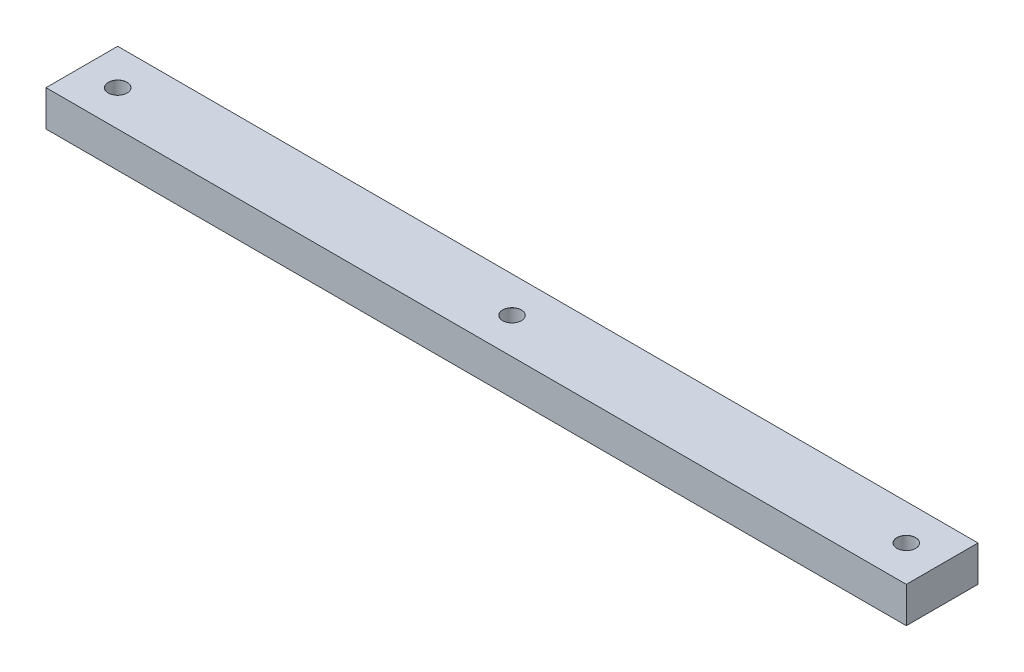
ISO-10303-21;
HEADER;
FILE_DESCRIPTION(('STEP AP214'),'2;1');
FILE_NAME('part.step','',(''),(''),'','','');
FILE_SCHEMA(('AUTOMOTIVE_DESIGN { 1 0 10303 214 1 1 1 1 }'));
ENDSEC;
DATA;
#1=APPLICATION_CONTEXT('core data for automotive mechanical design processes');
#2=APPLICATION_PROTOCOL_DEFINITION('international standard','automotive_design',2000,#1);
#3=PRODUCT_CONTEXT('',#1,'mechanical');
#4=PRODUCT('Part','Part','',(#3));
#5=PRODUCT_RELATED_PRODUCT_CATEGORY('part','',(#4));
#6=PRODUCT_DEFINITION_FORMATION('','',#4);
#7=PRODUCT_DEFINITION_CONTEXT('part definition',#1,'design');
#8=PRODUCT_DEFINITION('design','',#6,#7);
#9=PRODUCT_DEFINITION_SHAPE('','',#8);
#10=(LENGTH_UNIT() NAMED_UNIT(*) SI_UNIT(.MILLI.,.METRE.));
#11=(NAMED_UNIT(*) PLANE_ANGLE_UNIT() SI_UNIT($,.RADIAN.));
#12=(NAMED_UNIT(*) SI_UNIT($,.STERADIAN.) SOLID_ANGLE_UNIT());
#13=UNCERTAINTY_MEASURE_WITH_UNIT(LENGTH_MEASURE(1.E-05),#10,'distance_accuracy_value','');
#14=(GEOMETRIC_REPRESENTATION_CONTEXT(3) GLOBAL_UNCERTAINTY_ASSIGNED_CONTEXT((#13)) GLOBAL_UNIT_ASSIGNED_CONTEXT((#10,
#11,#12)) REPRESENTATION_CONTEXT('',''));
#15=CARTESIAN_POINT('',(0.,0.,0.));
#16=DIRECTION('',(0.,0.,1.));
#17=DIRECTION('',(1.,0.,0.));
#18=AXIS2_PLACEMENT_3D('',#15,#16,#17);
#19=CARTESIAN_POINT('',(-152.4,12.7,12.7));
#20=DIRECTION('',(1.,0.,0.));
#21=DIRECTION('',(0.,0.,-1.));
#22=AXIS2_PLACEMENT_3D('',#19,#20,#21);
#23=PLANE('',#22);
#24=DIRECTION('',(0.,0.,1.));
#25=VECTOR('',#24,1.);
#26=CARTESIAN_POINT('',(-152.4,0.,12.7));
#27=LINE('',#26,#25);
#28=CARTESIAN_POINT('',(-152.4,0.,-12.7));
#29=VERTEX_POINT('',#28);
#30=CARTESIAN_POINT('',(-152.4,0.,12.7));
#31=VERTEX_POINT('',#30);
#32=EDGE_CURVE('E102',#29,#31,#27,.T.);
#33=ORIENTED_EDGE('',*,*,#32,.T.);
#34=DIRECTION('',(0.,-1.,0.));
#35=VECTOR('',#34,1.);
#36=CARTESIAN_POINT('',(-152.4,12.7,12.7));
#37=LINE('',#36,#35);
#38=CARTESIAN_POINT('',(-152.4,12.7,12.7));
#39=VERTEX_POINT('',#38);
#40=EDGE_CURVE('E11',#39,#31,#37,.T.);
#41=ORIENTED_EDGE('',*,*,#40,.F.);
#42=DIRECTION('',(0.,0.,1.));
#43=VECTOR('',#42,1.);
#44=CARTESIAN_POINT('',(-152.4,12.7,12.7));
#45=LINE('',#44,#43);
#46=CARTESIAN_POINT('',(-152.4,12.7,-12.7));
#47=VERTEX_POINT('',#46);
#48=EDGE_CURVE('E90',#47,#39,#45,.T.);
#49=ORIENTED_EDGE('',*,*,#48,.F.);
#50=DIRECTION('',(0.,-1.,0.));
#51=VECTOR('',#50,1.);
#52=CARTESIAN_POINT('',(-152.4,12.7,-12.7));
#53=LINE('',#52,#51);
#54=EDGE_CURVE('E98',#47,#29,#53,.T.);
#55=ORIENTED_EDGE('',*,*,#54,.T.);
#56=EDGE_LOOP('',(#33,#41,#49,#55));
#57=FACE_BOUND('',#56,.T.);
#58=ADVANCED_FACE('F39',(#57),#23,.F.);
#59=CARTESIAN_POINT('',(152.4,12.7,12.7));
#60=DIRECTION('',(0.,0.,-1.));
#61=DIRECTION('',(-1.,0.,0.));
#62=AXIS2_PLACEMENT_3D('',#59,#60,#61);
#63=PLANE('',#62);
#64=DIRECTION('',(1.,0.,0.));
#65=VECTOR('',#64,1.);
#66=CARTESIAN_POINT('',(152.4,0.,12.7));
#67=LINE('',#66,#65);
#68=CARTESIAN_POINT('',(152.4,0.,12.7));
#69=VERTEX_POINT('',#68);
#70=EDGE_CURVE('E94',#31,#69,#67,.T.);
#71=ORIENTED_EDGE('',*,*,#70,.T.);
#72=DIRECTION('',(0.,-1.,0.));
#73=VECTOR('',#72,1.);
#74=CARTESIAN_POINT('',(152.4,12.7,12.7));
#75=LINE('',#74,#73);
#76=CARTESIAN_POINT('',(152.4,12.7,12.7));
#77=VERTEX_POINT('',#76);
#78=EDGE_CURVE('E47',#77,#69,#75,.T.);
#79=ORIENTED_EDGE('',*,*,#78,.F.);
#80=DIRECTION('',(1.,0.,0.));
#81=VECTOR('',#80,1.);
#82=CARTESIAN_POINT('',(152.4,12.7,12.7));
#83=LINE('',#82,#81);
#84=EDGE_CURVE('E85',#39,#77,#83,.T.);
#85=ORIENTED_EDGE('',*,*,#84,.F.);
#86=ORIENTED_EDGE('',*,*,#40,.T.);
#87=EDGE_LOOP('',(#71,#79,#85,#86));
#88=FACE_BOUND('',#87,.T.);
#89=ADVANCED_FACE('F93',(#88),#63,.F.);
#90=CARTESIAN_POINT('',(152.4,12.7,12.7));
#91=DIRECTION('',(-1.,0.,0.));
#92=DIRECTION('',(0.,0.,1.));
#93=AXIS2_PLACEMENT_3D('',#90,#91,#92);
#94=PLANE('',#93);
#95=DIRECTION('',(0.,0.,-1.));
#96=VECTOR('',#95,1.);
#97=CARTESIAN_POINT('',(152.4,0.,12.7));
#98=LINE('',#97,#96);
#99=CARTESIAN_POINT('',(152.4,0.,-12.7));
#100=VERTEX_POINT('',#99);
#101=EDGE_CURVE('E72',#69,#100,#98,.T.);
#102=ORIENTED_EDGE('',*,*,#101,.T.);
#103=DIRECTION('',(0.,-1.,0.));
#104=VECTOR('',#103,1.);
#105=CARTESIAN_POINT('',(152.4,12.7,-12.7));
#106=LINE('',#105,#104);
#107=CARTESIAN_POINT('',(152.4,12.7,-12.7));
#108=VERTEX_POINT('',#107);
#109=EDGE_CURVE('E95',#108,#100,#106,.T.);
#110=ORIENTED_EDGE('',*,*,#109,.F.);
#111=DIRECTION('',(0.,0.,-1.));
#112=VECTOR('',#111,1.);
#113=CARTESIAN_POINT('',(152.4,12.7,12.7));
#114=LINE('',#113,#112);
#115=EDGE_CURVE('E88',#77,#108,#114,.T.);
#116=ORIENTED_EDGE('',*,*,#115,.F.);
#117=ORIENTED_EDGE('',*,*,#78,.T.);
#118=EDGE_LOOP('',(#102,#110,#116,#117));
#119=FACE_BOUND('',#118,.T.);
#120=ADVANCED_FACE('F96',(#119),#94,.F.);
#121=CARTESIAN_POINT('',(152.4,12.7,-12.7));
#122=DIRECTION('',(0.,0.,1.));
#123=DIRECTION('',(1.,0.,0.));
#124=AXIS2_PLACEMENT_3D('',#121,#122,#123);
#125=PLANE('',#124);
#126=DIRECTION('',(-1.,0.,0.));
#127=VECTOR('',#126,1.);
#128=CARTESIAN_POINT('',(152.4,0.,-12.7));
#129=LINE('',#128,#127);
#130=EDGE_CURVE('E78',#100,#29,#129,.T.);
#131=ORIENTED_EDGE('',*,*,#130,.T.);
#132=ORIENTED_EDGE('',*,*,#54,.F.);
#133=DIRECTION('',(-1.,0.,0.));
#134=VECTOR('',#133,1.);
#135=CARTESIAN_POINT('',(152.4,12.7,-12.7));
#136=LINE('',#135,#134);
#137=EDGE_CURVE('E55',#108,#47,#136,.T.);
#138=ORIENTED_EDGE('',*,*,#137,.F.);
#139=ORIENTED_EDGE('',*,*,#109,.T.);
#140=EDGE_LOOP('',(#131,#132,#138,#139));
#141=FACE_BOUND('',#140,.T.);
#142=ADVANCED_FACE('F110',(#141),#125,.F.);
#143=CARTESIAN_POINT('',(0.,12.7,0.));
#144=DIRECTION('',(0.,1.,0.));
#145=DIRECTION('',(0.,0.,1.));
#146=AXIS2_PLACEMENT_3D('',#143,#144,#145);
#147=PLANE('',#146);
#148=CARTESIAN_POINT('',(0.,12.7,0.));
#149=DIRECTION('',(0.,1.,0.));
#150=DIRECTION('',(0.,0.,1.));
#151=AXIS2_PLACEMENT_3D('',#148,#149,#150);
#152=CIRCLE('',#151,3.325);
#153=CARTESIAN_POINT('',(0.,12.7,3.325));
#154=VERTEX_POINT('',#153);
#155=EDGE_CURVE('E139',#154,#154,#152,.T.);
#156=ORIENTED_EDGE('',*,*,#155,.F.);
#157=EDGE_LOOP('',(#156));
#158=FACE_BOUND('',#157,.T.);
#159=CARTESIAN_POINT('',(-139.7,12.7,0.));
#160=DIRECTION('',(0.,1.,0.));
#161=DIRECTION('',(0.,0.,1.));
#162=AXIS2_PLACEMENT_3D('',#159,#160,#161);
#163=CIRCLE('',#162,3.32499999999999);
#164=CARTESIAN_POINT('',(-139.7,12.7,3.32500000000001));
#165=VERTEX_POINT('',#164);
#166=EDGE_CURVE('E130',#165,#165,#163,.T.);
#167=ORIENTED_EDGE('',*,*,#166,.F.);
#168=EDGE_LOOP('',(#167));
#169=FACE_BOUND('',#168,.T.);
#170=CARTESIAN_POINT('',(139.7,12.7,0.));
#171=DIRECTION('',(0.,1.,0.));
#172=DIRECTION('',(0.,0.,1.));
#173=AXIS2_PLACEMENT_3D('',#170,#171,#172);
#174=CIRCLE('',#173,3.32499999999999);
#175=CARTESIAN_POINT('',(139.7,12.7,3.32500000000001));
#176=VERTEX_POINT('',#175);
#177=EDGE_CURVE('E121',#176,#176,#174,.T.);
#178=ORIENTED_EDGE('',*,*,#177,.F.);
#179=EDGE_LOOP('',(#178));
#180=FACE_BOUND('',#179,.T.);
#181=ORIENTED_EDGE('',*,*,#48,.T.);
#182=ORIENTED_EDGE('',*,*,#84,.T.);
#183=ORIENTED_EDGE('',*,*,#115,.T.);
#184=ORIENTED_EDGE('',*,*,#137,.T.);
#185=EDGE_LOOP('',(#181,#182,#183,#184));
#186=FACE_BOUND('',#185,.T.);
#187=ADVANCED_FACE('F86',(#158,#169,#180,#186),#147,.T.);
#188=CARTESIAN_POINT('',(0.,0.,0.));
#189=DIRECTION('',(0.,1.,0.));
#190=DIRECTION('',(0.,0.,1.));
#191=AXIS2_PLACEMENT_3D('',#188,#189,#190);
#192=PLANE('',#191);
#193=CARTESIAN_POINT('',(0.,0.,0.));
#194=DIRECTION('',(0.,1.,0.));
#195=DIRECTION('',(0.,0.,1.));
#196=AXIS2_PLACEMENT_3D('',#193,#194,#195);
#197=CIRCLE('',#196,3.3);
#198=CARTESIAN_POINT('',(0.,0.,3.3));
#199=VERTEX_POINT('',#198);
#200=EDGE_CURVE('E133',#199,#199,#197,.T.);
#201=ORIENTED_EDGE('',*,*,#200,.T.);
#202=EDGE_LOOP('',(#201));
#203=FACE_BOUND('',#202,.T.);
#204=CARTESIAN_POINT('',(-139.7,0.,0.));
#205=DIRECTION('',(0.,1.,0.));
#206=DIRECTION('',(0.,0.,1.));
#207=AXIS2_PLACEMENT_3D('',#204,#205,#206);
#208=CIRCLE('',#207,3.3);
#209=CARTESIAN_POINT('',(-139.7,0.,3.30000000000002));
#210=VERTEX_POINT('',#209);
#211=EDGE_CURVE('E124',#210,#210,#208,.T.);
#212=ORIENTED_EDGE('',*,*,#211,.T.);
#213=EDGE_LOOP('',(#212));
#214=FACE_BOUND('',#213,.T.);
#215=CARTESIAN_POINT('',(139.7,0.,0.));
#216=DIRECTION('',(0.,1.,0.));
#217=DIRECTION('',(0.,0.,1.));
#218=AXIS2_PLACEMENT_3D('',#215,#216,#217);
#219=CIRCLE('',#218,3.3);
#220=CARTESIAN_POINT('',(139.7,0.,3.30000000000002));
#221=VERTEX_POINT('',#220);
#222=EDGE_CURVE('E105',#221,#221,#219,.T.);
#223=ORIENTED_EDGE('',*,*,#222,.T.);
#224=EDGE_LOOP('',(#223));
#225=FACE_BOUND('',#224,.T.);
#226=ORIENTED_EDGE('',*,*,#32,.F.);
#227=ORIENTED_EDGE('',*,*,#130,.F.);
#228=ORIENTED_EDGE('',*,*,#101,.F.);
#229=ORIENTED_EDGE('',*,*,#70,.F.);
#230=EDGE_LOOP('',(#226,#227,#228,#229));
#231=FACE_BOUND('',#230,.T.);
#232=ADVANCED_FACE('F113',(#203,#214,#225,#231),#192,.F.);
#233=CARTESIAN_POINT('',(139.7,12.7,0.));
#234=DIRECTION('',(0.,1.,0.));
#235=DIRECTION('',(0.,0.,1.));
#236=AXIS2_PLACEMENT_3D('',#233,#234,#235);
#237=CYLINDRICAL_SURFACE('',#236,3.3);
#238=ORIENTED_EDGE('',*,*,#222,.F.);
#239=EDGE_LOOP('',(#238));
#240=FACE_BOUND('',#239,.T.);
#241=CARTESIAN_POINT('',(139.7,12.675,0.));
#242=DIRECTION('',(0.,1.,0.));
#243=DIRECTION('',(0.,0.,1.));
#244=AXIS2_PLACEMENT_3D('',#241,#242,#243);
#245=CIRCLE('',#244,3.3);
#246=CARTESIAN_POINT('',(139.7,12.675,3.30000000000002));
#247=VERTEX_POINT('',#246);
#248=EDGE_CURVE('E118',#247,#247,#245,.T.);
#249=ORIENTED_EDGE('',*,*,#248,.T.);
#250=EDGE_LOOP('',(#249));
#251=FACE_BOUND('',#250,.T.);
#252=ADVANCED_FACE('F155',(#240,#251),#237,.F.);
#253=CARTESIAN_POINT('',(139.7,12.7,0.));
#254=DIRECTION('',(0.,1.,0.));
#255=DIRECTION('',(0.,0.,1.));
#256=AXIS2_PLACEMENT_3D('',#253,#254,#255);
#257=CONICAL_SURFACE('',#256,3.32499999999999,0.785398163397414);
#258=ORIENTED_EDGE('',*,*,#248,.F.);
#259=EDGE_LOOP('',(#258));
#260=FACE_BOUND('',#259,.T.);
#261=ORIENTED_EDGE('',*,*,#177,.T.);
#262=EDGE_LOOP('',(#261));
#263=FACE_BOUND('',#262,.T.);
#264=ADVANCED_FACE('F152',(#260,#263),#257,.F.);
#265=CARTESIAN_POINT('',(-139.7,12.7,0.));
#266=DIRECTION('',(0.,1.,0.));
#267=DIRECTION('',(0.,0.,1.));
#268=AXIS2_PLACEMENT_3D('',#265,#266,#267);
#269=CYLINDRICAL_SURFACE('',#268,3.3);
#270=ORIENTED_EDGE('',*,*,#211,.F.);
#271=EDGE_LOOP('',(#270));
#272=FACE_BOUND('',#271,.T.);
#273=CARTESIAN_POINT('',(-139.7,12.675,0.));
#274=DIRECTION('',(0.,1.,0.));
#275=DIRECTION('',(0.,0.,1.));
#276=AXIS2_PLACEMENT_3D('',#273,#274,#275);
#277=CIRCLE('',#276,3.3);
#278=CARTESIAN_POINT('',(-139.7,12.675,3.30000000000002));
#279=VERTEX_POINT('',#278);
#280=EDGE_CURVE('E127',#279,#279,#277,.T.);
#281=ORIENTED_EDGE('',*,*,#280,.T.);
#282=EDGE_LOOP('',(#281));
#283=FACE_BOUND('',#282,.T.);
#284=ADVANCED_FACE('F154',(#272,#283),#269,.F.);
#285=CARTESIAN_POINT('',(-139.7,12.7,0.));
#286=DIRECTION('',(0.,1.,0.));
#287=DIRECTION('',(0.,0.,1.));
#288=AXIS2_PLACEMENT_3D('',#285,#286,#287);
#289=CONICAL_SURFACE('',#288,3.32499999999999,0.785398163397414);
#290=ORIENTED_EDGE('',*,*,#280,.F.);
#291=EDGE_LOOP('',(#290));
#292=FACE_BOUND('',#291,.T.);
#293=ORIENTED_EDGE('',*,*,#166,.T.);
#294=EDGE_LOOP('',(#293));
#295=FACE_BOUND('',#294,.T.);
#296=ADVANCED_FACE('F162',(#292,#295),#289,.F.);
#297=CARTESIAN_POINT('',(0.,12.7,0.));
#298=DIRECTION('',(0.,1.,0.));
#299=DIRECTION('',(0.,0.,1.));
#300=AXIS2_PLACEMENT_3D('',#297,#298,#299);
#301=CYLINDRICAL_SURFACE('',#300,3.29999999999999);
#302=ORIENTED_EDGE('',*,*,#200,.F.);
#303=EDGE_LOOP('',(#302));
#304=FACE_BOUND('',#303,.T.);
#305=CARTESIAN_POINT('',(0.,12.675,0.));
#306=DIRECTION('',(0.,1.,0.));
#307=DIRECTION('',(0.,0.,1.));
#308=AXIS2_PLACEMENT_3D('',#305,#306,#307);
#309=CIRCLE('',#308,3.29999999999999);
#310=CARTESIAN_POINT('',(0.,12.675,3.29999999999999));
#311=VERTEX_POINT('',#310);
#312=EDGE_CURVE('E136',#311,#311,#309,.T.);
#313=ORIENTED_EDGE('',*,*,#312,.T.);
#314=EDGE_LOOP('',(#313));
#315=FACE_BOUND('',#314,.T.);
#316=ADVANCED_FACE('F194',(#304,#315),#301,.F.);
#317=CARTESIAN_POINT('',(0.,12.7,0.));
#318=DIRECTION('',(0.,1.,0.));
#319=DIRECTION('',(0.,0.,1.));
#320=AXIS2_PLACEMENT_3D('',#317,#318,#319);
#321=CONICAL_SURFACE('',#320,3.325,0.785398163397726);
#322=ORIENTED_EDGE('',*,*,#312,.F.);
#323=EDGE_LOOP('',(#322));
#324=FACE_BOUND('',#323,.T.);
#325=ORIENTED_EDGE('',*,*,#155,.T.);
#326=EDGE_LOOP('',(#325));
#327=FACE_BOUND('',#326,.T.);
#328=ADVANCED_FACE('F143',(#324,#327),#321,.F.);
#329=CLOSED_SHELL('',(#58,#89,#120,#142,#187,#232,#252,#264,#284,#296,#316,#328));
#330=MANIFOLD_SOLID_BREP('B2',#329);
#331=ADVANCED_BREP_SHAPE_REPRESENTATION('',(#18,#330),#14);
#332=SHAPE_DEFINITION_REPRESENTATION(#9,#331);
ENDSEC;
END-ISO-10303-21;
